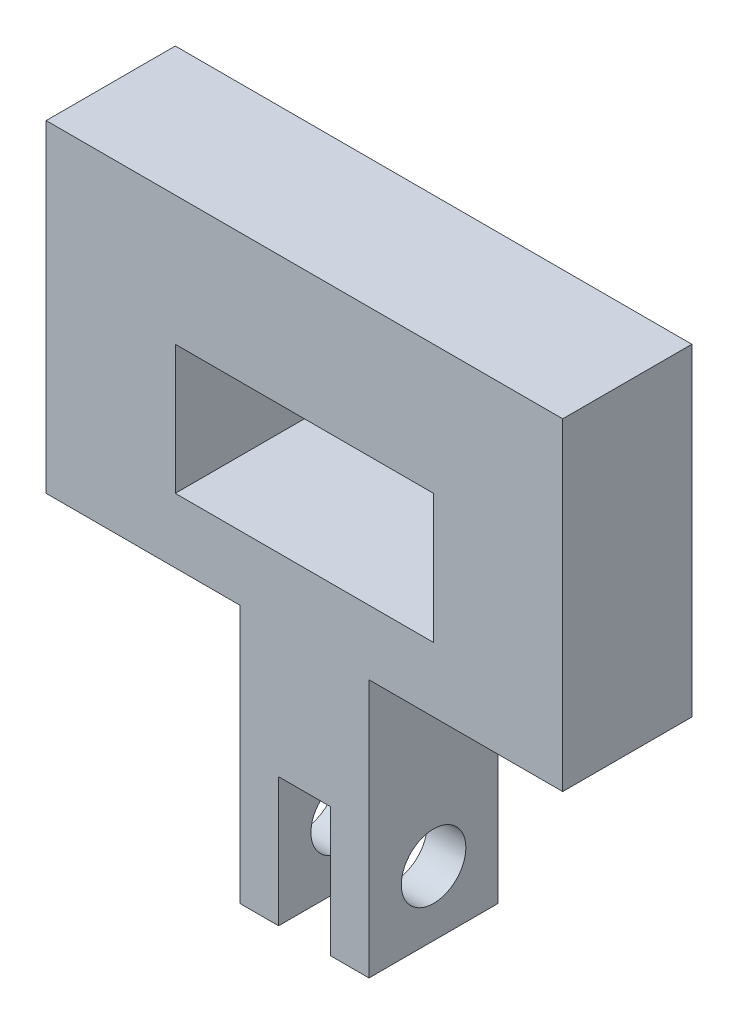
ISO-10303-21;
HEADER;
FILE_DESCRIPTION(('STEP AP214'),'2;1');
FILE_NAME('part.step','',(''),(''),'','','');
FILE_SCHEMA(('AUTOMOTIVE_DESIGN { 1 0 10303 214 1 1 1 1 }'));
ENDSEC;
DATA;
#1=APPLICATION_CONTEXT('core data for automotive mechanical design processes');
#2=APPLICATION_PROTOCOL_DEFINITION('international standard','automotive_design',2000,#1);
#3=PRODUCT_CONTEXT('',#1,'mechanical');
#4=PRODUCT('Part','Part','',(#3));
#5=PRODUCT_RELATED_PRODUCT_CATEGORY('part','',(#4));
#6=PRODUCT_DEFINITION_FORMATION('','',#4);
#7=PRODUCT_DEFINITION_CONTEXT('part definition',#1,'design');
#8=PRODUCT_DEFINITION('design','',#6,#7);
#9=PRODUCT_DEFINITION_SHAPE('','',#8);
#10=(LENGTH_UNIT() NAMED_UNIT(*) SI_UNIT(.MILLI.,.METRE.));
#11=(NAMED_UNIT(*) PLANE_ANGLE_UNIT() SI_UNIT($,.RADIAN.));
#12=(NAMED_UNIT(*) SI_UNIT($,.STERADIAN.) SOLID_ANGLE_UNIT());
#13=UNCERTAINTY_MEASURE_WITH_UNIT(LENGTH_MEASURE(1.E-05),#10,'distance_accuracy_value','');
#14=(GEOMETRIC_REPRESENTATION_CONTEXT(3) GLOBAL_UNCERTAINTY_ASSIGNED_CONTEXT((#13)) GLOBAL_UNIT_ASSIGNED_CONTEXT((#10,
#11,#12)) REPRESENTATION_CONTEXT('',''));
#15=CARTESIAN_POINT('',(0.,0.,0.));
#16=DIRECTION('',(0.,0.,1.));
#17=DIRECTION('',(1.,0.,0.));
#18=AXIS2_PLACEMENT_3D('',#15,#16,#17);
#19=CARTESIAN_POINT('',(-20.,15.,-5.));
#20=DIRECTION('',(-1.,0.,0.));
#21=DIRECTION('',(0.,-1.,0.));
#22=AXIS2_PLACEMENT_3D('',#19,#20,#21);
#23=PLANE('',#22);
#24=DIRECTION('',(0.,0.,1.));
#25=VECTOR('',#24,1.);
#26=CARTESIAN_POINT('',(-20.,-10.,-5.));
#27=LINE('',#26,#25);
#28=CARTESIAN_POINT('',(-20.,-10.,-5.));
#29=VERTEX_POINT('',#28);
#30=CARTESIAN_POINT('',(-20.,-10.,5.));
#31=VERTEX_POINT('',#30);
#32=EDGE_CURVE('E258',#29,#31,#27,.T.);
#33=ORIENTED_EDGE('',*,*,#32,.T.);
#34=DIRECTION('',(0.,-1.,0.));
#35=VECTOR('',#34,1.);
#36=CARTESIAN_POINT('',(-20.,15.,5.));
#37=LINE('',#36,#35);
#38=CARTESIAN_POINT('',(-20.,15.,5.));
#39=VERTEX_POINT('',#38);
#40=EDGE_CURVE('E178',#39,#31,#37,.T.);
#41=ORIENTED_EDGE('',*,*,#40,.F.);
#42=DIRECTION('',(0.,0.,1.));
#43=VECTOR('',#42,1.);
#44=CARTESIAN_POINT('',(-20.,15.,-5.));
#45=LINE('',#44,#43);
#46=CARTESIAN_POINT('',(-20.,15.,-5.));
#47=VERTEX_POINT('',#46);
#48=EDGE_CURVE('E11',#47,#39,#45,.T.);
#49=ORIENTED_EDGE('',*,*,#48,.F.);
#50=DIRECTION('',(0.,-1.,0.));
#51=VECTOR('',#50,1.);
#52=CARTESIAN_POINT('',(-20.,15.,-5.));
#53=LINE('',#52,#51);
#54=EDGE_CURVE('E221',#47,#29,#53,.T.);
#55=ORIENTED_EDGE('',*,*,#54,.T.);
#56=EDGE_LOOP('',(#33,#41,#49,#55));
#57=FACE_BOUND('',#56,.T.);
#58=ADVANCED_FACE('F33',(#57),#23,.T.);
#59=CARTESIAN_POINT('',(-20.,15.,-5.));
#60=DIRECTION('',(0.,1.,0.));
#61=DIRECTION('',(0.,0.,1.));
#62=AXIS2_PLACEMENT_3D('',#59,#60,#61);
#63=PLANE('',#62);
#64=ORIENTED_EDGE('',*,*,#48,.T.);
#65=DIRECTION('',(-1.,0.,0.));
#66=VECTOR('',#65,1.);
#67=CARTESIAN_POINT('',(-20.,15.,5.));
#68=LINE('',#67,#66);
#69=CARTESIAN_POINT('',(20.,15.,5.));
#70=VERTEX_POINT('',#69);
#71=EDGE_CURVE('E211',#70,#39,#68,.T.);
#72=ORIENTED_EDGE('',*,*,#71,.F.);
#73=DIRECTION('',(0.,0.,1.));
#74=VECTOR('',#73,1.);
#75=CARTESIAN_POINT('',(20.,15.,-5.));
#76=LINE('',#75,#74);
#77=CARTESIAN_POINT('',(20.,15.,-5.));
#78=VERTEX_POINT('',#77);
#79=EDGE_CURVE('E41',#78,#70,#76,.T.);
#80=ORIENTED_EDGE('',*,*,#79,.F.);
#81=DIRECTION('',(-1.,0.,0.));
#82=VECTOR('',#81,1.);
#83=CARTESIAN_POINT('',(-20.,15.,-5.));
#84=LINE('',#83,#82);
#85=EDGE_CURVE('E256',#78,#47,#84,.T.);
#86=ORIENTED_EDGE('',*,*,#85,.T.);
#87=EDGE_LOOP('',(#64,#72,#80,#86));
#88=FACE_BOUND('',#87,.T.);
#89=ADVANCED_FACE('F287',(#88),#63,.T.);
#90=CARTESIAN_POINT('',(20.,15.,-5.));
#91=DIRECTION('',(1.,0.,0.));
#92=DIRECTION('',(0.,0.,-1.));
#93=AXIS2_PLACEMENT_3D('',#90,#91,#92);
#94=PLANE('',#93);
#95=ORIENTED_EDGE('',*,*,#79,.T.);
#96=DIRECTION('',(0.,1.,0.));
#97=VECTOR('',#96,1.);
#98=CARTESIAN_POINT('',(20.,15.,5.));
#99=LINE('',#98,#97);
#100=CARTESIAN_POINT('',(20.,-10.,5.));
#101=VERTEX_POINT('',#100);
#102=EDGE_CURVE('E208',#101,#70,#99,.T.);
#103=ORIENTED_EDGE('',*,*,#102,.F.);
#104=DIRECTION('',(0.,0.,1.));
#105=VECTOR('',#104,1.);
#106=CARTESIAN_POINT('',(20.,-10.,-5.));
#107=LINE('',#106,#105);
#108=CARTESIAN_POINT('',(20.,-10.,-5.));
#109=VERTEX_POINT('',#108);
#110=EDGE_CURVE('E261',#109,#101,#107,.T.);
#111=ORIENTED_EDGE('',*,*,#110,.F.);
#112=DIRECTION('',(0.,1.,0.));
#113=VECTOR('',#112,1.);
#114=CARTESIAN_POINT('',(20.,15.,-5.));
#115=LINE('',#114,#113);
#116=EDGE_CURVE('E253',#109,#78,#115,.T.);
#117=ORIENTED_EDGE('',*,*,#116,.T.);
#118=EDGE_LOOP('',(#95,#103,#111,#117));
#119=FACE_BOUND('',#118,.T.);
#120=ADVANCED_FACE('F324',(#119),#94,.T.);
#121=CARTESIAN_POINT('',(5.,-10.,-5.));
#122=DIRECTION('',(0.,-1.,0.));
#123=DIRECTION('',(0.,0.,-1.));
#124=AXIS2_PLACEMENT_3D('',#121,#122,#123);
#125=PLANE('',#124);
#126=ORIENTED_EDGE('',*,*,#110,.T.);
#127=DIRECTION('',(1.,0.,0.));
#128=VECTOR('',#127,1.);
#129=CARTESIAN_POINT('',(5.,-10.,5.));
#130=LINE('',#129,#128);
#131=CARTESIAN_POINT('',(5.,-10.,5.));
#132=VERTEX_POINT('',#131);
#133=EDGE_CURVE('E205',#132,#101,#130,.T.);
#134=ORIENTED_EDGE('',*,*,#133,.F.);
#135=DIRECTION('',(0.,0.,1.));
#136=VECTOR('',#135,1.);
#137=CARTESIAN_POINT('',(5.,-10.,-5.));
#138=LINE('',#137,#136);
#139=CARTESIAN_POINT('',(5.,-10.,-5.));
#140=VERTEX_POINT('',#139);
#141=EDGE_CURVE('E263',#140,#132,#138,.T.);
#142=ORIENTED_EDGE('',*,*,#141,.F.);
#143=DIRECTION('',(1.,0.,0.));
#144=VECTOR('',#143,1.);
#145=CARTESIAN_POINT('',(5.,-10.,-5.));
#146=LINE('',#145,#144);
#147=EDGE_CURVE('E250',#140,#109,#146,.T.);
#148=ORIENTED_EDGE('',*,*,#147,.T.);
#149=EDGE_LOOP('',(#126,#134,#142,#148));
#150=FACE_BOUND('',#149,.T.);
#151=ADVANCED_FACE('F322',(#150),#125,.T.);
#152=CARTESIAN_POINT('',(5.,-30.,-5.));
#153=DIRECTION('',(1.,0.,0.));
#154=DIRECTION('',(0.,1.,0.));
#155=AXIS2_PLACEMENT_3D('',#152,#153,#154);
#156=PLANE('',#155);
#157=CARTESIAN_POINT('',(5.,-25.,0.));
#158=DIRECTION('',(1.,0.,0.));
#159=DIRECTION('',(0.,1.,0.));
#160=AXIS2_PLACEMENT_3D('',#157,#158,#159);
#161=CIRCLE('',#160,2.5);
#162=CARTESIAN_POINT('',(5.,-22.5,0.));
#163=VERTEX_POINT('',#162);
#164=EDGE_CURVE('E497',#163,#163,#161,.T.);
#165=ORIENTED_EDGE('',*,*,#164,.F.);
#166=EDGE_LOOP('',(#165));
#167=FACE_BOUND('',#166,.T.);
#168=ORIENTED_EDGE('',*,*,#141,.T.);
#169=DIRECTION('',(0.,1.,0.));
#170=VECTOR('',#169,1.);
#171=CARTESIAN_POINT('',(5.,-30.,5.));
#172=LINE('',#171,#170);
#173=CARTESIAN_POINT('',(5.,-30.,5.));
#174=VERTEX_POINT('',#173);
#175=EDGE_CURVE('E202',#174,#132,#172,.T.);
#176=ORIENTED_EDGE('',*,*,#175,.F.);
#177=DIRECTION('',(0.,0.,1.));
#178=VECTOR('',#177,1.);
#179=CARTESIAN_POINT('',(5.,-30.,-5.));
#180=LINE('',#179,#178);
#181=CARTESIAN_POINT('',(5.,-30.,-5.));
#182=VERTEX_POINT('',#181);
#183=EDGE_CURVE('E265',#182,#174,#180,.T.);
#184=ORIENTED_EDGE('',*,*,#183,.F.);
#185=DIRECTION('',(0.,1.,0.));
#186=VECTOR('',#185,1.);
#187=CARTESIAN_POINT('',(5.,-30.,-5.));
#188=LINE('',#187,#186);
#189=EDGE_CURVE('E247',#182,#140,#188,.T.);
#190=ORIENTED_EDGE('',*,*,#189,.T.);
#191=EDGE_LOOP('',(#168,#176,#184,#190));
#192=FACE_BOUND('',#191,.T.);
#193=ADVANCED_FACE('F318',(#167,#192),#156,.T.);
#194=CARTESIAN_POINT('',(2.,-30.,-5.));
#195=DIRECTION('',(0.,-1.,0.));
#196=DIRECTION('',(0.,0.,-1.));
#197=AXIS2_PLACEMENT_3D('',#194,#195,#196);
#198=PLANE('',#197);
#199=ORIENTED_EDGE('',*,*,#183,.T.);
#200=DIRECTION('',(1.,0.,0.));
#201=VECTOR('',#200,1.);
#202=CARTESIAN_POINT('',(2.,-30.,5.));
#203=LINE('',#202,#201);
#204=CARTESIAN_POINT('',(2.,-30.,5.));
#205=VERTEX_POINT('',#204);
#206=EDGE_CURVE('E199',#205,#174,#203,.T.);
#207=ORIENTED_EDGE('',*,*,#206,.F.);
#208=DIRECTION('',(0.,0.,1.));
#209=VECTOR('',#208,1.);
#210=CARTESIAN_POINT('',(2.,-30.,-5.));
#211=LINE('',#210,#209);
#212=CARTESIAN_POINT('',(2.,-30.,-5.));
#213=VERTEX_POINT('',#212);
#214=EDGE_CURVE('E267',#213,#205,#211,.T.);
#215=ORIENTED_EDGE('',*,*,#214,.F.);
#216=DIRECTION('',(1.,0.,0.));
#217=VECTOR('',#216,1.);
#218=CARTESIAN_POINT('',(2.,-30.,-5.));
#219=LINE('',#218,#217);
#220=EDGE_CURVE('E244',#213,#182,#219,.T.);
#221=ORIENTED_EDGE('',*,*,#220,.T.);
#222=EDGE_LOOP('',(#199,#207,#215,#221));
#223=FACE_BOUND('',#222,.T.);
#224=ADVANCED_FACE('F315',(#223),#198,.T.);
#225=CARTESIAN_POINT('',(1.99999999999999,-20.,-5.));
#226=DIRECTION('',(-1.,0.,0.));
#227=DIRECTION('',(0.,-1.,0.));
#228=AXIS2_PLACEMENT_3D('',#225,#226,#227);
#229=PLANE('',#228);
#230=CARTESIAN_POINT('',(1.99999999999999,-25.,0.));
#231=DIRECTION('',(-1.,0.,0.));
#232=DIRECTION('',(0.,-1.,0.));
#233=AXIS2_PLACEMENT_3D('',#230,#231,#232);
#234=CIRCLE('',#233,2.5);
#235=CARTESIAN_POINT('',(2.,-27.5,0.));
#236=VERTEX_POINT('',#235);
#237=EDGE_CURVE('E167',#236,#236,#234,.T.);
#238=ORIENTED_EDGE('',*,*,#237,.F.);
#239=EDGE_LOOP('',(#238));
#240=FACE_BOUND('',#239,.T.);
#241=ORIENTED_EDGE('',*,*,#214,.T.);
#242=DIRECTION('',(0.,-1.,0.));
#243=VECTOR('',#242,1.);
#244=CARTESIAN_POINT('',(1.99999999999999,-20.,5.));
#245=LINE('',#244,#243);
#246=CARTESIAN_POINT('',(1.99999999999999,-20.,5.));
#247=VERTEX_POINT('',#246);
#248=EDGE_CURVE('E196',#247,#205,#245,.T.);
#249=ORIENTED_EDGE('',*,*,#248,.F.);
#250=DIRECTION('',(0.,0.,1.));
#251=VECTOR('',#250,1.);
#252=CARTESIAN_POINT('',(1.99999999999999,-20.,-5.));
#253=LINE('',#252,#251);
#254=CARTESIAN_POINT('',(1.99999999999999,-20.,-5.));
#255=VERTEX_POINT('',#254);
#256=EDGE_CURVE('E269',#255,#247,#253,.T.);
#257=ORIENTED_EDGE('',*,*,#256,.F.);
#258=DIRECTION('',(0.,-1.,0.));
#259=VECTOR('',#258,1.);
#260=CARTESIAN_POINT('',(1.99999999999999,-20.,-5.));
#261=LINE('',#260,#259);
#262=EDGE_CURVE('E241',#255,#213,#261,.T.);
#263=ORIENTED_EDGE('',*,*,#262,.T.);
#264=EDGE_LOOP('',(#241,#249,#257,#263));
#265=FACE_BOUND('',#264,.T.);
#266=ADVANCED_FACE('F313',(#240,#265),#229,.T.);
#267=CARTESIAN_POINT('',(-2.,-20.,-5.));
#268=DIRECTION('',(0.,-1.,0.));
#269=DIRECTION('',(0.,0.,-1.));
#270=AXIS2_PLACEMENT_3D('',#267,#268,#269);
#271=PLANE('',#270);
#272=ORIENTED_EDGE('',*,*,#256,.T.);
#273=DIRECTION('',(1.,0.,0.));
#274=VECTOR('',#273,1.);
#275=CARTESIAN_POINT('',(-2.,-20.,5.));
#276=LINE('',#275,#274);
#277=CARTESIAN_POINT('',(-2.,-20.,5.));
#278=VERTEX_POINT('',#277);
#279=EDGE_CURVE('E193',#278,#247,#276,.T.);
#280=ORIENTED_EDGE('',*,*,#279,.F.);
#281=DIRECTION('',(0.,0.,1.));
#282=VECTOR('',#281,1.);
#283=CARTESIAN_POINT('',(-2.,-20.,-5.));
#284=LINE('',#283,#282);
#285=CARTESIAN_POINT('',(-2.,-20.,-5.));
#286=VERTEX_POINT('',#285);
#287=EDGE_CURVE('E271',#286,#278,#284,.T.);
#288=ORIENTED_EDGE('',*,*,#287,.F.);
#289=DIRECTION('',(1.,0.,0.));
#290=VECTOR('',#289,1.);
#291=CARTESIAN_POINT('',(-2.,-20.,-5.));
#292=LINE('',#291,#290);
#293=EDGE_CURVE('E238',#286,#255,#292,.T.);
#294=ORIENTED_EDGE('',*,*,#293,.T.);
#295=EDGE_LOOP('',(#272,#280,#288,#294));
#296=FACE_BOUND('',#295,.T.);
#297=ADVANCED_FACE('F308',(#296),#271,.T.);
#298=CARTESIAN_POINT('',(-2.,-30.,-5.));
#299=DIRECTION('',(1.,0.,0.));
#300=DIRECTION('',(0.,0.,-1.));
#301=AXIS2_PLACEMENT_3D('',#298,#299,#300);
#302=PLANE('',#301);
#303=CARTESIAN_POINT('',(-2.,-25.,0.));
#304=DIRECTION('',(1.,0.,0.));
#305=DIRECTION('',(0.,0.,-1.));
#306=AXIS2_PLACEMENT_3D('',#303,#304,#305);
#307=CIRCLE('',#306,2.5);
#308=CARTESIAN_POINT('',(-2.,-25.,-2.5));
#309=VERTEX_POINT('',#308);
#310=EDGE_CURVE('E500',#309,#309,#307,.T.);
#311=ORIENTED_EDGE('',*,*,#310,.F.);
#312=EDGE_LOOP('',(#311));
#313=FACE_BOUND('',#312,.T.);
#314=ORIENTED_EDGE('',*,*,#287,.T.);
#315=DIRECTION('',(0.,1.,0.));
#316=VECTOR('',#315,1.);
#317=CARTESIAN_POINT('',(-2.,-30.,5.));
#318=LINE('',#317,#316);
#319=CARTESIAN_POINT('',(-2.,-30.,5.));
#320=VERTEX_POINT('',#319);
#321=EDGE_CURVE('E190',#320,#278,#318,.T.);
#322=ORIENTED_EDGE('',*,*,#321,.F.);
#323=DIRECTION('',(0.,0.,1.));
#324=VECTOR('',#323,1.);
#325=CARTESIAN_POINT('',(-2.,-30.,-5.));
#326=LINE('',#325,#324);
#327=CARTESIAN_POINT('',(-2.,-30.,-5.));
#328=VERTEX_POINT('',#327);
#329=EDGE_CURVE('E273',#328,#320,#326,.T.);
#330=ORIENTED_EDGE('',*,*,#329,.F.);
#331=DIRECTION('',(0.,1.,0.));
#332=VECTOR('',#331,1.);
#333=CARTESIAN_POINT('',(-2.,-30.,-5.));
#334=LINE('',#333,#332);
#335=EDGE_CURVE('E235',#328,#286,#334,.T.);
#336=ORIENTED_EDGE('',*,*,#335,.T.);
#337=EDGE_LOOP('',(#314,#322,#330,#336));
#338=FACE_BOUND('',#337,.T.);
#339=ADVANCED_FACE('F303',(#313,#338),#302,.T.);
#340=CARTESIAN_POINT('',(-5.,-30.,-5.));
#341=DIRECTION('',(0.,-1.,0.));
#342=DIRECTION('',(0.,0.,-1.));
#343=AXIS2_PLACEMENT_3D('',#340,#341,#342);
#344=PLANE('',#343);
#345=ORIENTED_EDGE('',*,*,#329,.T.);
#346=DIRECTION('',(1.,0.,0.));
#347=VECTOR('',#346,1.);
#348=CARTESIAN_POINT('',(-5.,-30.,5.));
#349=LINE('',#348,#347);
#350=CARTESIAN_POINT('',(-5.,-30.,5.));
#351=VERTEX_POINT('',#350);
#352=EDGE_CURVE('E187',#351,#320,#349,.T.);
#353=ORIENTED_EDGE('',*,*,#352,.F.);
#354=DIRECTION('',(0.,0.,1.));
#355=VECTOR('',#354,1.);
#356=CARTESIAN_POINT('',(-5.,-30.,-5.));
#357=LINE('',#356,#355);
#358=CARTESIAN_POINT('',(-5.,-30.,-5.));
#359=VERTEX_POINT('',#358);
#360=EDGE_CURVE('E275',#359,#351,#357,.T.);
#361=ORIENTED_EDGE('',*,*,#360,.F.);
#362=DIRECTION('',(1.,0.,0.));
#363=VECTOR('',#362,1.);
#364=CARTESIAN_POINT('',(-5.,-30.,-5.));
#365=LINE('',#364,#363);
#366=EDGE_CURVE('E232',#359,#328,#365,.T.);
#367=ORIENTED_EDGE('',*,*,#366,.T.);
#368=EDGE_LOOP('',(#345,#353,#361,#367));
#369=FACE_BOUND('',#368,.T.);
#370=ADVANCED_FACE('F301',(#369),#344,.T.);
#371=CARTESIAN_POINT('',(-5.,-10.,-5.));
#372=DIRECTION('',(-1.,0.,0.));
#373=DIRECTION('',(0.,-1.,0.));
#374=AXIS2_PLACEMENT_3D('',#371,#372,#373);
#375=PLANE('',#374);
#376=CARTESIAN_POINT('',(-5.,-25.,0.));
#377=DIRECTION('',(-1.,0.,0.));
#378=DIRECTION('',(0.,-1.,0.));
#379=AXIS2_PLACEMENT_3D('',#376,#377,#378);
#380=CIRCLE('',#379,2.5);
#381=CARTESIAN_POINT('',(-5.,-27.5,0.));
#382=VERTEX_POINT('',#381);
#383=EDGE_CURVE('E36',#382,#382,#380,.T.);
#384=ORIENTED_EDGE('',*,*,#383,.F.);
#385=EDGE_LOOP('',(#384));
#386=FACE_BOUND('',#385,.T.);
#387=ORIENTED_EDGE('',*,*,#360,.T.);
#388=DIRECTION('',(0.,-1.,0.));
#389=VECTOR('',#388,1.);
#390=CARTESIAN_POINT('',(-5.,-10.,5.));
#391=LINE('',#390,#389);
#392=CARTESIAN_POINT('',(-5.,-10.,5.));
#393=VERTEX_POINT('',#392);
#394=EDGE_CURVE('E184',#393,#351,#391,.T.);
#395=ORIENTED_EDGE('',*,*,#394,.F.);
#396=DIRECTION('',(0.,0.,1.));
#397=VECTOR('',#396,1.);
#398=CARTESIAN_POINT('',(-5.,-10.,-5.));
#399=LINE('',#398,#397);
#400=CARTESIAN_POINT('',(-5.,-10.,-5.));
#401=VERTEX_POINT('',#400);
#402=EDGE_CURVE('E277',#401,#393,#399,.T.);
#403=ORIENTED_EDGE('',*,*,#402,.F.);
#404=DIRECTION('',(0.,-1.,0.));
#405=VECTOR('',#404,1.);
#406=CARTESIAN_POINT('',(-5.,-10.,-5.));
#407=LINE('',#406,#405);
#408=EDGE_CURVE('E229',#401,#359,#407,.T.);
#409=ORIENTED_EDGE('',*,*,#408,.T.);
#410=EDGE_LOOP('',(#387,#395,#403,#409));
#411=FACE_BOUND('',#410,.T.);
#412=ADVANCED_FACE('F297',(#386,#411),#375,.T.);
#413=CARTESIAN_POINT('',(-20.,-10.,-5.));
#414=DIRECTION('',(0.,-1.,0.));
#415=DIRECTION('',(0.,0.,-1.));
#416=AXIS2_PLACEMENT_3D('',#413,#414,#415);
#417=PLANE('',#416);
#418=ORIENTED_EDGE('',*,*,#402,.T.);
#419=DIRECTION('',(1.,0.,0.));
#420=VECTOR('',#419,1.);
#421=CARTESIAN_POINT('',(-20.,-10.,5.));
#422=LINE('',#421,#420);
#423=EDGE_CURVE('E181',#31,#393,#422,.T.);
#424=ORIENTED_EDGE('',*,*,#423,.F.);
#425=ORIENTED_EDGE('',*,*,#32,.F.);
#426=DIRECTION('',(1.,0.,0.));
#427=VECTOR('',#426,1.);
#428=CARTESIAN_POINT('',(-20.,-10.,-5.));
#429=LINE('',#428,#427);
#430=EDGE_CURVE('E226',#29,#401,#429,.T.);
#431=ORIENTED_EDGE('',*,*,#430,.T.);
#432=EDGE_LOOP('',(#418,#424,#425,#431));
#433=FACE_BOUND('',#432,.T.);
#434=ADVANCED_FACE('F281',(#433),#417,.T.);
#435=CARTESIAN_POINT('',(0.,0.,-5.));
#436=DIRECTION('',(0.,0.,1.));
#437=DIRECTION('',(1.,0.,0.));
#438=AXIS2_PLACEMENT_3D('',#435,#436,#437);
#439=PLANE('',#438);
#440=DIRECTION('',(1.,0.,0.));
#441=VECTOR('',#440,1.);
#442=CARTESIAN_POINT('',(-10.,-5.,-5.));
#443=LINE('',#442,#441);
#444=CARTESIAN_POINT('',(-10.,-5.,-5.));
#445=VERTEX_POINT('',#444);
#446=CARTESIAN_POINT('',(10.,-5.,-5.));
#447=VERTEX_POINT('',#446);
#448=EDGE_CURVE('E158',#445,#447,#443,.T.);
#449=ORIENTED_EDGE('',*,*,#448,.T.);
#450=DIRECTION('',(0.,1.,0.));
#451=VECTOR('',#450,1.);
#452=CARTESIAN_POINT('',(10.,5.,-5.));
#453=LINE('',#452,#451);
#454=CARTESIAN_POINT('',(10.,5.,-5.));
#455=VERTEX_POINT('',#454);
#456=EDGE_CURVE('E214',#447,#455,#453,.T.);
#457=ORIENTED_EDGE('',*,*,#456,.T.);
#458=DIRECTION('',(-1.,0.,0.));
#459=VECTOR('',#458,1.);
#460=CARTESIAN_POINT('',(-10.,5.,-5.));
#461=LINE('',#460,#459);
#462=CARTESIAN_POINT('',(-10.,5.,-5.));
#463=VERTEX_POINT('',#462);
#464=EDGE_CURVE('E153',#455,#463,#461,.T.);
#465=ORIENTED_EDGE('',*,*,#464,.T.);
#466=DIRECTION('',(0.,-1.,0.));
#467=VECTOR('',#466,1.);
#468=CARTESIAN_POINT('',(-10.,5.,-5.));
#469=LINE('',#468,#467);
#470=EDGE_CURVE('E49',#463,#445,#469,.T.);
#471=ORIENTED_EDGE('',*,*,#470,.T.);
#472=EDGE_LOOP('',(#449,#457,#465,#471));
#473=FACE_BOUND('',#472,.T.);
#474=ORIENTED_EDGE('',*,*,#54,.F.);
#475=ORIENTED_EDGE('',*,*,#85,.F.);
#476=ORIENTED_EDGE('',*,*,#116,.F.);
#477=ORIENTED_EDGE('',*,*,#147,.F.);
#478=ORIENTED_EDGE('',*,*,#189,.F.);
#479=ORIENTED_EDGE('',*,*,#220,.F.);
#480=ORIENTED_EDGE('',*,*,#262,.F.);
#481=ORIENTED_EDGE('',*,*,#293,.F.);
#482=ORIENTED_EDGE('',*,*,#335,.F.);
#483=ORIENTED_EDGE('',*,*,#366,.F.);
#484=ORIENTED_EDGE('',*,*,#408,.F.);
#485=ORIENTED_EDGE('',*,*,#430,.F.);
#486=EDGE_LOOP('',(#474,#475,#476,#477,#478,#479,#480,#481,#482,#483,#484,#485));
#487=FACE_BOUND('',#486,.T.);
#488=ADVANCED_FACE('F291',(#473,#487),#439,.F.);
#489=CARTESIAN_POINT('',(10.,5.,-5.));
#490=DIRECTION('',(1.,0.,0.));
#491=DIRECTION('',(0.,0.,-1.));
#492=AXIS2_PLACEMENT_3D('',#489,#490,#491);
#493=PLANE('',#492);
#494=DIRECTION('',(0.,0.,1.));
#495=VECTOR('',#494,1.);
#496=CARTESIAN_POINT('',(10.,-5.,-5.));
#497=LINE('',#496,#495);
#498=CARTESIAN_POINT('',(10.,-5.,5.));
#499=VERTEX_POINT('',#498);
#500=EDGE_CURVE('E163',#447,#499,#497,.T.);
#501=ORIENTED_EDGE('',*,*,#500,.T.);
#502=DIRECTION('',(0.,1.,0.));
#503=VECTOR('',#502,1.);
#504=CARTESIAN_POINT('',(10.,5.,5.));
#505=LINE('',#504,#503);
#506=CARTESIAN_POINT('',(10.,5.,5.));
#507=VERTEX_POINT('',#506);
#508=EDGE_CURVE('E161',#499,#507,#505,.T.);
#509=ORIENTED_EDGE('',*,*,#508,.T.);
#510=DIRECTION('',(0.,0.,1.));
#511=VECTOR('',#510,1.);
#512=CARTESIAN_POINT('',(10.,5.,-5.));
#513=LINE('',#512,#511);
#514=EDGE_CURVE('E146',#455,#507,#513,.T.);
#515=ORIENTED_EDGE('',*,*,#514,.F.);
#516=ORIENTED_EDGE('',*,*,#456,.F.);
#517=EDGE_LOOP('',(#501,#509,#515,#516));
#518=FACE_BOUND('',#517,.T.);
#519=ADVANCED_FACE('F162',(#518),#493,.F.);
#520=CARTESIAN_POINT('',(-10.,-5.,-5.));
#521=DIRECTION('',(0.,-1.,0.));
#522=DIRECTION('',(0.,0.,-1.));
#523=AXIS2_PLACEMENT_3D('',#520,#521,#522);
#524=PLANE('',#523);
#525=DIRECTION('',(0.,0.,1.));
#526=VECTOR('',#525,1.);
#527=CARTESIAN_POINT('',(-10.,-5.,-5.));
#528=LINE('',#527,#526);
#529=CARTESIAN_POINT('',(-10.,-5.,5.));
#530=VERTEX_POINT('',#529);
#531=EDGE_CURVE('E222',#445,#530,#528,.T.);
#532=ORIENTED_EDGE('',*,*,#531,.T.);
#533=DIRECTION('',(1.,0.,0.));
#534=VECTOR('',#533,1.);
#535=CARTESIAN_POINT('',(-10.,-5.,5.));
#536=LINE('',#535,#534);
#537=EDGE_CURVE('E173',#530,#499,#536,.T.);
#538=ORIENTED_EDGE('',*,*,#537,.T.);
#539=ORIENTED_EDGE('',*,*,#500,.F.);
#540=ORIENTED_EDGE('',*,*,#448,.F.);
#541=EDGE_LOOP('',(#532,#538,#539,#540));
#542=FACE_BOUND('',#541,.T.);
#543=ADVANCED_FACE('F407',(#542),#524,.F.);
#544=CARTESIAN_POINT('',(-10.,5.,-5.));
#545=DIRECTION('',(-1.,0.,0.));
#546=DIRECTION('',(0.,-1.,0.));
#547=AXIS2_PLACEMENT_3D('',#544,#545,#546);
#548=PLANE('',#547);
#549=DIRECTION('',(0.,0.,1.));
#550=VECTOR('',#549,1.);
#551=CARTESIAN_POINT('',(-10.,5.,-5.));
#552=LINE('',#551,#550);
#553=CARTESIAN_POINT('',(-10.,5.,5.));
#554=VERTEX_POINT('',#553);
#555=EDGE_CURVE('E157',#463,#554,#552,.T.);
#556=ORIENTED_EDGE('',*,*,#555,.T.);
#557=DIRECTION('',(0.,-1.,0.));
#558=VECTOR('',#557,1.);
#559=CARTESIAN_POINT('',(-10.,5.,5.));
#560=LINE('',#559,#558);
#561=EDGE_CURVE('E171',#554,#530,#560,.T.);
#562=ORIENTED_EDGE('',*,*,#561,.T.);
#563=ORIENTED_EDGE('',*,*,#531,.F.);
#564=ORIENTED_EDGE('',*,*,#470,.F.);
#565=EDGE_LOOP('',(#556,#562,#563,#564));
#566=FACE_BOUND('',#565,.T.);
#567=ADVANCED_FACE('F416',(#566),#548,.F.);
#568=CARTESIAN_POINT('',(-10.,5.,-5.));
#569=DIRECTION('',(0.,1.,0.));
#570=DIRECTION('',(0.,0.,1.));
#571=AXIS2_PLACEMENT_3D('',#568,#569,#570);
#572=PLANE('',#571);
#573=ORIENTED_EDGE('',*,*,#514,.T.);
#574=DIRECTION('',(-1.,0.,0.));
#575=VECTOR('',#574,1.);
#576=CARTESIAN_POINT('',(-10.,5.,5.));
#577=LINE('',#576,#575);
#578=EDGE_CURVE('E150',#507,#554,#577,.T.);
#579=ORIENTED_EDGE('',*,*,#578,.T.);
#580=ORIENTED_EDGE('',*,*,#555,.F.);
#581=ORIENTED_EDGE('',*,*,#464,.F.);
#582=EDGE_LOOP('',(#573,#579,#580,#581));
#583=FACE_BOUND('',#582,.T.);
#584=ADVANCED_FACE('F148',(#583),#572,.F.);
#585=CARTESIAN_POINT('',(0.,0.,5.));
#586=DIRECTION('',(0.,0.,1.));
#587=DIRECTION('',(1.,0.,0.));
#588=AXIS2_PLACEMENT_3D('',#585,#586,#587);
#589=PLANE('',#588);
#590=ORIENTED_EDGE('',*,*,#40,.T.);
#591=ORIENTED_EDGE('',*,*,#423,.T.);
#592=ORIENTED_EDGE('',*,*,#394,.T.);
#593=ORIENTED_EDGE('',*,*,#352,.T.);
#594=ORIENTED_EDGE('',*,*,#321,.T.);
#595=ORIENTED_EDGE('',*,*,#279,.T.);
#596=ORIENTED_EDGE('',*,*,#248,.T.);
#597=ORIENTED_EDGE('',*,*,#206,.T.);
#598=ORIENTED_EDGE('',*,*,#175,.T.);
#599=ORIENTED_EDGE('',*,*,#133,.T.);
#600=ORIENTED_EDGE('',*,*,#102,.T.);
#601=ORIENTED_EDGE('',*,*,#71,.T.);
#602=EDGE_LOOP('',(#590,#591,#592,#593,#594,#595,#596,#597,#598,#599,#600,#601));
#603=FACE_BOUND('',#602,.T.);
#604=ORIENTED_EDGE('',*,*,#578,.F.);
#605=ORIENTED_EDGE('',*,*,#508,.F.);
#606=ORIENTED_EDGE('',*,*,#537,.F.);
#607=ORIENTED_EDGE('',*,*,#561,.F.);
#608=EDGE_LOOP('',(#604,#605,#606,#607));
#609=FACE_BOUND('',#608,.T.);
#610=ADVANCED_FACE('F169',(#603,#609),#589,.T.);
#611=CARTESIAN_POINT('',(-20.,-25.,0.));
#612=DIRECTION('',(1.,0.,0.));
#613=DIRECTION('',(0.,1.,0.));
#614=AXIS2_PLACEMENT_3D('',#611,#612,#613);
#615=CYLINDRICAL_SURFACE('',#614,2.5);
#616=ORIENTED_EDGE('',*,*,#310,.T.);
#617=EDGE_LOOP('',(#616));
#618=FACE_BOUND('',#617,.T.);
#619=ORIENTED_EDGE('',*,*,#383,.T.);
#620=EDGE_LOOP('',(#619));
#621=FACE_BOUND('',#620,.T.);
#622=ADVANCED_FACE('F442',(#618,#621),#615,.F.);
#623=ORIENTED_EDGE('',*,*,#237,.T.);
#624=EDGE_LOOP('',(#623));
#625=FACE_BOUND('',#624,.T.);
#626=ORIENTED_EDGE('',*,*,#164,.T.);
#627=EDGE_LOOP('',(#626));
#628=FACE_BOUND('',#627,.T.);
#629=ADVANCED_FACE('F479',(#625,#628),#615,.F.);
#630=CLOSED_SHELL('',(#58,#89,#120,#151,#193,#224,#266,#297,#339,#370,#412,#434,#488,#519,#543,
#567,#584,#610,#622,#629));
#631=MANIFOLD_SOLID_BREP('B2',#630);
#632=ADVANCED_BREP_SHAPE_REPRESENTATION('',(#18,#631),#14);
#633=SHAPE_DEFINITION_REPRESENTATION(#9,#632);
ENDSEC;
END-ISO-10303-21;
